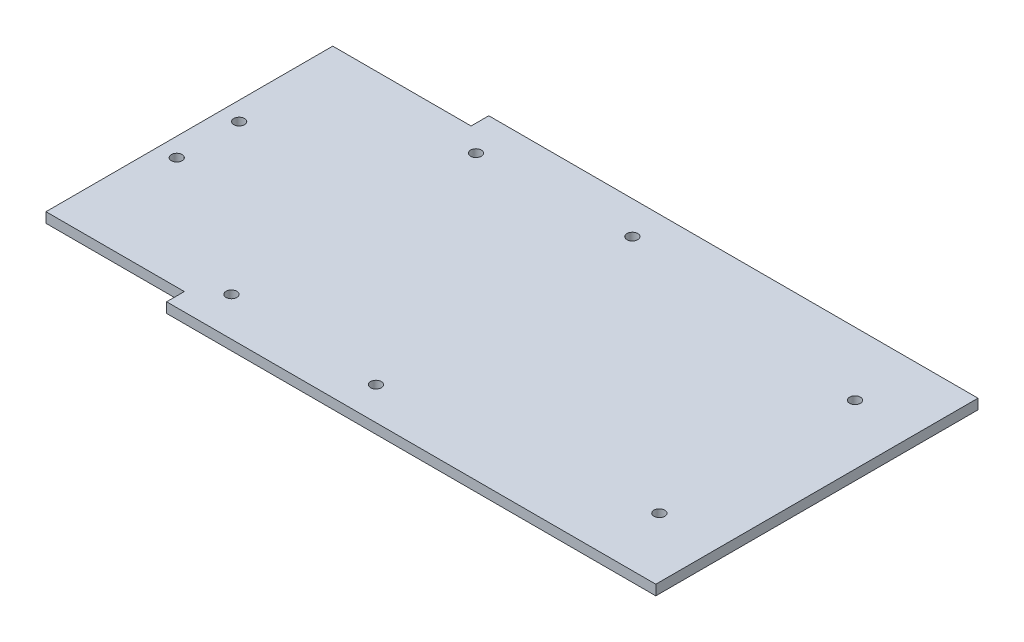
ISO-10303-21;
HEADER;
FILE_DESCRIPTION(('STEP AP214'),'2;1');
FILE_NAME('part.step','',(''),(''),'','','');
FILE_SCHEMA(('AUTOMOTIVE_DESIGN { 1 0 10303 214 1 1 1 1 }'));
ENDSEC;
DATA;
#1=APPLICATION_CONTEXT('core data for automotive mechanical design processes');
#2=APPLICATION_PROTOCOL_DEFINITION('international standard','automotive_design',2000,#1);
#3=PRODUCT_CONTEXT('',#1,'mechanical');
#4=PRODUCT('Part','Part','',(#3));
#5=PRODUCT_RELATED_PRODUCT_CATEGORY('part','',(#4));
#6=PRODUCT_DEFINITION_FORMATION('','',#4);
#7=PRODUCT_DEFINITION_CONTEXT('part definition',#1,'design');
#8=PRODUCT_DEFINITION('design','',#6,#7);
#9=PRODUCT_DEFINITION_SHAPE('','',#8);
#10=(LENGTH_UNIT() NAMED_UNIT(*) SI_UNIT(.MILLI.,.METRE.));
#11=(NAMED_UNIT(*) PLANE_ANGLE_UNIT() SI_UNIT($,.RADIAN.));
#12=(NAMED_UNIT(*) SI_UNIT($,.STERADIAN.) SOLID_ANGLE_UNIT());
#13=UNCERTAINTY_MEASURE_WITH_UNIT(LENGTH_MEASURE(1.E-05),#10,'distance_accuracy_value','');
#14=(GEOMETRIC_REPRESENTATION_CONTEXT(3) GLOBAL_UNCERTAINTY_ASSIGNED_CONTEXT((#13)) GLOBAL_UNIT_ASSIGNED_CONTEXT((#10,
#11,#12)) REPRESENTATION_CONTEXT('',''));
#15=CARTESIAN_POINT('',(0.,0.,0.));
#16=DIRECTION('',(0.,0.,1.));
#17=DIRECTION('',(1.,0.,0.));
#18=AXIS2_PLACEMENT_3D('',#15,#16,#17);
#19=CARTESIAN_POINT('',(186.,3.,-95.5));
#20=DIRECTION('',(-1.,0.,0.));
#21=DIRECTION('',(0.,0.,1.));
#22=AXIS2_PLACEMENT_3D('',#19,#20,#21);
#23=PLANE('',#22);
#24=DIRECTION('',(0.,0.,-1.));
#25=VECTOR('',#24,1.);
#26=CARTESIAN_POINT('',(186.,0.,-95.5));
#27=LINE('',#26,#25);
#28=CARTESIAN_POINT('',(186.,0.,0.));
#29=VERTEX_POINT('',#28);
#30=CARTESIAN_POINT('',(186.,0.,-95.5));
#31=VERTEX_POINT('',#30);
#32=EDGE_CURVE('E132',#29,#31,#27,.T.);
#33=ORIENTED_EDGE('',*,*,#32,.T.);
#34=DIRECTION('',(0.,-1.,0.));
#35=VECTOR('',#34,1.);
#36=CARTESIAN_POINT('',(186.,3.,-95.5));
#37=LINE('',#36,#35);
#38=CARTESIAN_POINT('',(186.,3.,-95.5));
#39=VERTEX_POINT('',#38);
#40=EDGE_CURVE('E11',#39,#31,#37,.T.);
#41=ORIENTED_EDGE('',*,*,#40,.F.);
#42=DIRECTION('',(0.,0.,-1.));
#43=VECTOR('',#42,1.);
#44=CARTESIAN_POINT('',(186.,3.,-95.5));
#45=LINE('',#44,#43);
#46=CARTESIAN_POINT('',(186.,3.,0.));
#47=VERTEX_POINT('',#46);
#48=EDGE_CURVE('E147',#47,#39,#45,.T.);
#49=ORIENTED_EDGE('',*,*,#48,.F.);
#50=DIRECTION('',(0.,-1.,0.));
#51=VECTOR('',#50,1.);
#52=CARTESIAN_POINT('',(186.,3.,0.));
#53=LINE('',#52,#51);
#54=EDGE_CURVE('E128',#47,#29,#53,.T.);
#55=ORIENTED_EDGE('',*,*,#54,.T.);
#56=EDGE_LOOP('',(#33,#41,#49,#55));
#57=FACE_BOUND('',#56,.T.);
#58=ADVANCED_FACE('F36',(#57),#23,.F.);
#59=CARTESIAN_POINT('',(41.,3.,-95.5));
#60=DIRECTION('',(0.,0.,1.));
#61=DIRECTION('',(1.,0.,0.));
#62=AXIS2_PLACEMENT_3D('',#59,#60,#61);
#63=PLANE('',#62);
#64=DIRECTION('',(-1.,0.,0.));
#65=VECTOR('',#64,1.);
#66=CARTESIAN_POINT('',(41.,0.,-95.5));
#67=LINE('',#66,#65);
#68=CARTESIAN_POINT('',(41.,0.,-95.5));
#69=VERTEX_POINT('',#68);
#70=EDGE_CURVE('E135',#31,#69,#67,.T.);
#71=ORIENTED_EDGE('',*,*,#70,.T.);
#72=DIRECTION('',(0.,-1.,0.));
#73=VECTOR('',#72,1.);
#74=CARTESIAN_POINT('',(41.,3.,-95.5));
#75=LINE('',#74,#73);
#76=CARTESIAN_POINT('',(41.,3.,-95.5));
#77=VERTEX_POINT('',#76);
#78=EDGE_CURVE('E44',#77,#69,#75,.T.);
#79=ORIENTED_EDGE('',*,*,#78,.F.);
#80=DIRECTION('',(-1.,0.,0.));
#81=VECTOR('',#80,1.);
#82=CARTESIAN_POINT('',(41.,3.,-95.5));
#83=LINE('',#82,#81);
#84=EDGE_CURVE('E95',#39,#77,#83,.T.);
#85=ORIENTED_EDGE('',*,*,#84,.F.);
#86=ORIENTED_EDGE('',*,*,#40,.T.);
#87=EDGE_LOOP('',(#71,#79,#85,#86));
#88=FACE_BOUND('',#87,.T.);
#89=ADVANCED_FACE('F265',(#88),#63,.F.);
#90=CARTESIAN_POINT('',(41.,3.,-95.5));
#91=DIRECTION('',(1.,0.,0.));
#92=DIRECTION('',(0.,0.,-1.));
#93=AXIS2_PLACEMENT_3D('',#90,#91,#92);
#94=PLANE('',#93);
#95=DIRECTION('',(0.,0.,1.));
#96=VECTOR('',#95,1.);
#97=CARTESIAN_POINT('',(41.,0.,-95.5));
#98=LINE('',#97,#96);
#99=CARTESIAN_POINT('',(41.,0.,-90.25));
#100=VERTEX_POINT('',#99);
#101=EDGE_CURVE('E138',#69,#100,#98,.T.);
#102=ORIENTED_EDGE('',*,*,#101,.T.);
#103=DIRECTION('',(0.,-1.,0.));
#104=VECTOR('',#103,1.);
#105=CARTESIAN_POINT('',(41.,3.,-90.25));
#106=LINE('',#105,#104);
#107=CARTESIAN_POINT('',(41.,3.,-90.25));
#108=VERTEX_POINT('',#107);
#109=EDGE_CURVE('E154',#108,#100,#106,.T.);
#110=ORIENTED_EDGE('',*,*,#109,.F.);
#111=DIRECTION('',(0.,0.,1.));
#112=VECTOR('',#111,1.);
#113=CARTESIAN_POINT('',(41.,3.,-95.5));
#114=LINE('',#113,#112);
#115=EDGE_CURVE('E162',#77,#108,#114,.T.);
#116=ORIENTED_EDGE('',*,*,#115,.F.);
#117=ORIENTED_EDGE('',*,*,#78,.T.);
#118=EDGE_LOOP('',(#102,#110,#116,#117));
#119=FACE_BOUND('',#118,.T.);
#120=ADVANCED_FACE('F160',(#119),#94,.F.);
#121=CARTESIAN_POINT('',(0.,3.,-90.25));
#122=DIRECTION('',(0.,0.,1.));
#123=DIRECTION('',(1.,0.,0.));
#124=AXIS2_PLACEMENT_3D('',#121,#122,#123);
#125=PLANE('',#124);
#126=DIRECTION('',(-1.,0.,0.));
#127=VECTOR('',#126,1.);
#128=CARTESIAN_POINT('',(0.,0.,-90.25));
#129=LINE('',#128,#127);
#130=CARTESIAN_POINT('',(0.,0.,-90.25));
#131=VERTEX_POINT('',#130);
#132=EDGE_CURVE('E140',#100,#131,#129,.T.);
#133=ORIENTED_EDGE('',*,*,#132,.T.);
#134=DIRECTION('',(0.,-1.,0.));
#135=VECTOR('',#134,1.);
#136=CARTESIAN_POINT('',(0.,3.,-90.25));
#137=LINE('',#136,#135);
#138=CARTESIAN_POINT('',(0.,3.,-90.25));
#139=VERTEX_POINT('',#138);
#140=EDGE_CURVE('E151',#139,#131,#137,.T.);
#141=ORIENTED_EDGE('',*,*,#140,.F.);
#142=DIRECTION('',(-1.,0.,0.));
#143=VECTOR('',#142,1.);
#144=CARTESIAN_POINT('',(0.,3.,-90.25));
#145=LINE('',#144,#143);
#146=EDGE_CURVE('E174',#108,#139,#145,.T.);
#147=ORIENTED_EDGE('',*,*,#146,.F.);
#148=ORIENTED_EDGE('',*,*,#109,.T.);
#149=EDGE_LOOP('',(#133,#141,#147,#148));
#150=FACE_BOUND('',#149,.T.);
#151=ADVANCED_FACE('F170',(#150),#125,.F.);
#152=CARTESIAN_POINT('',(0.,3.,-90.25));
#153=DIRECTION('',(1.,0.,0.));
#154=DIRECTION('',(0.,0.,-1.));
#155=AXIS2_PLACEMENT_3D('',#152,#153,#154);
#156=PLANE('',#155);
#157=DIRECTION('',(0.,0.,1.));
#158=VECTOR('',#157,1.);
#159=CARTESIAN_POINT('',(0.,0.,-90.25));
#160=LINE('',#159,#158);
#161=CARTESIAN_POINT('',(0.,0.,-5.25));
#162=VERTEX_POINT('',#161);
#163=EDGE_CURVE('E142',#131,#162,#160,.T.);
#164=ORIENTED_EDGE('',*,*,#163,.T.);
#165=DIRECTION('',(0.,-1.,0.));
#166=VECTOR('',#165,1.);
#167=CARTESIAN_POINT('',(0.,3.,-5.25));
#168=LINE('',#167,#166);
#169=CARTESIAN_POINT('',(0.,3.,-5.25));
#170=VERTEX_POINT('',#169);
#171=EDGE_CURVE('E123',#170,#162,#168,.T.);
#172=ORIENTED_EDGE('',*,*,#171,.F.);
#173=DIRECTION('',(0.,0.,1.));
#174=VECTOR('',#173,1.);
#175=CARTESIAN_POINT('',(0.,3.,-90.25));
#176=LINE('',#175,#174);
#177=EDGE_CURVE('E114',#139,#170,#176,.T.);
#178=ORIENTED_EDGE('',*,*,#177,.F.);
#179=ORIENTED_EDGE('',*,*,#140,.T.);
#180=EDGE_LOOP('',(#164,#172,#178,#179));
#181=FACE_BOUND('',#180,.T.);
#182=ADVANCED_FACE('F173',(#181),#156,.F.);
#183=CARTESIAN_POINT('',(0.,3.,-5.25));
#184=DIRECTION('',(0.,0.,-1.));
#185=DIRECTION('',(-1.,0.,0.));
#186=AXIS2_PLACEMENT_3D('',#183,#184,#185);
#187=PLANE('',#186);
#188=DIRECTION('',(1.,0.,0.));
#189=VECTOR('',#188,1.);
#190=CARTESIAN_POINT('',(0.,0.,-5.25));
#191=LINE('',#190,#189);
#192=CARTESIAN_POINT('',(41.,0.,-5.25));
#193=VERTEX_POINT('',#192);
#194=EDGE_CURVE('E122',#162,#193,#191,.T.);
#195=ORIENTED_EDGE('',*,*,#194,.T.);
#196=DIRECTION('',(0.,-1.,0.));
#197=VECTOR('',#196,1.);
#198=CARTESIAN_POINT('',(41.,3.,-5.25));
#199=LINE('',#198,#197);
#200=CARTESIAN_POINT('',(41.,3.,-5.25));
#201=VERTEX_POINT('',#200);
#202=EDGE_CURVE('E119',#201,#193,#199,.T.);
#203=ORIENTED_EDGE('',*,*,#202,.F.);
#204=DIRECTION('',(1.,0.,0.));
#205=VECTOR('',#204,1.);
#206=CARTESIAN_POINT('',(0.,3.,-5.25));
#207=LINE('',#206,#205);
#208=EDGE_CURVE('E108',#170,#201,#207,.T.);
#209=ORIENTED_EDGE('',*,*,#208,.F.);
#210=ORIENTED_EDGE('',*,*,#171,.T.);
#211=EDGE_LOOP('',(#195,#203,#209,#210));
#212=FACE_BOUND('',#211,.T.);
#213=ADVANCED_FACE('F120',(#212),#187,.F.);
#214=CARTESIAN_POINT('',(41.,3.,-5.25));
#215=DIRECTION('',(1.,0.,0.));
#216=DIRECTION('',(0.,0.,-1.));
#217=AXIS2_PLACEMENT_3D('',#214,#215,#216);
#218=PLANE('',#217);
#219=DIRECTION('',(0.,0.,1.));
#220=VECTOR('',#219,1.);
#221=CARTESIAN_POINT('',(41.,0.,-5.25));
#222=LINE('',#221,#220);
#223=CARTESIAN_POINT('',(41.,0.,0.));
#224=VERTEX_POINT('',#223);
#225=EDGE_CURVE('E81',#193,#224,#222,.T.);
#226=ORIENTED_EDGE('',*,*,#225,.T.);
#227=DIRECTION('',(0.,-1.,0.));
#228=VECTOR('',#227,1.);
#229=CARTESIAN_POINT('',(41.,3.,0.));
#230=LINE('',#229,#228);
#231=CARTESIAN_POINT('',(41.,3.,0.));
#232=VERTEX_POINT('',#231);
#233=EDGE_CURVE('E124',#232,#224,#230,.T.);
#234=ORIENTED_EDGE('',*,*,#233,.F.);
#235=DIRECTION('',(0.,0.,1.));
#236=VECTOR('',#235,1.);
#237=CARTESIAN_POINT('',(41.,3.,-5.25));
#238=LINE('',#237,#236);
#239=EDGE_CURVE('E112',#201,#232,#238,.T.);
#240=ORIENTED_EDGE('',*,*,#239,.F.);
#241=ORIENTED_EDGE('',*,*,#202,.T.);
#242=EDGE_LOOP('',(#226,#234,#240,#241));
#243=FACE_BOUND('',#242,.T.);
#244=ADVANCED_FACE('F126',(#243),#218,.F.);
#245=CARTESIAN_POINT('',(41.,3.,0.));
#246=DIRECTION('',(0.,0.,-1.));
#247=DIRECTION('',(-1.,0.,0.));
#248=AXIS2_PLACEMENT_3D('',#245,#246,#247);
#249=PLANE('',#248);
#250=DIRECTION('',(1.,0.,0.));
#251=VECTOR('',#250,1.);
#252=CARTESIAN_POINT('',(41.,0.,0.));
#253=LINE('',#252,#251);
#254=EDGE_CURVE('E87',#224,#29,#253,.T.);
#255=ORIENTED_EDGE('',*,*,#254,.T.);
#256=ORIENTED_EDGE('',*,*,#54,.F.);
#257=DIRECTION('',(1.,0.,0.));
#258=VECTOR('',#257,1.);
#259=CARTESIAN_POINT('',(41.,3.,0.));
#260=LINE('',#259,#258);
#261=EDGE_CURVE('E52',#232,#47,#260,.T.);
#262=ORIENTED_EDGE('',*,*,#261,.F.);
#263=ORIENTED_EDGE('',*,*,#233,.T.);
#264=EDGE_LOOP('',(#255,#256,#262,#263));
#265=FACE_BOUND('',#264,.T.);
#266=ADVANCED_FACE('F240',(#265),#249,.F.);
#267=CARTESIAN_POINT('',(0.,3.,0.));
#268=DIRECTION('',(0.,1.,0.));
#269=DIRECTION('',(0.,0.,1.));
#270=AXIS2_PLACEMENT_3D('',#267,#268,#269);
#271=PLANE('',#270);
#272=CARTESIAN_POINT('',(93.3,3.,-9.75));
#273=DIRECTION('',(0.,1.,0.));
#274=DIRECTION('',(0.,0.,1.));
#275=AXIS2_PLACEMENT_3D('',#272,#273,#274);
#276=CIRCLE('',#275,1.6);
#277=CARTESIAN_POINT('',(93.3,3.,-8.15));
#278=VERTEX_POINT('',#277);
#279=EDGE_CURVE('E198',#278,#278,#276,.T.);
#280=ORIENTED_EDGE('',*,*,#279,.F.);
#281=EDGE_LOOP('',(#280));
#282=FACE_BOUND('',#281,.T.);
#283=CARTESIAN_POINT('',(48.7,3.,-84.));
#284=DIRECTION('',(0.,1.,0.));
#285=DIRECTION('',(0.,0.,-1.));
#286=AXIS2_PLACEMENT_3D('',#283,#284,#285);
#287=CIRCLE('',#286,1.6);
#288=CARTESIAN_POINT('',(48.7,3.,-85.6));
#289=VERTEX_POINT('',#288);
#290=EDGE_CURVE('E205',#289,#289,#287,.T.);
#291=ORIENTED_EDGE('',*,*,#290,.F.);
#292=EDGE_LOOP('',(#291));
#293=FACE_BOUND('',#292,.T.);
#294=CARTESIAN_POINT('',(93.3,3.,-85.75));
#295=DIRECTION('',(0.,1.,0.));
#296=DIRECTION('',(0.,0.,-1.));
#297=AXIS2_PLACEMENT_3D('',#294,#295,#296);
#298=CIRCLE('',#297,1.60000000000001);
#299=CARTESIAN_POINT('',(93.3,3.,-87.35));
#300=VERTEX_POINT('',#299);
#301=EDGE_CURVE('E186',#300,#300,#298,.T.);
#302=ORIENTED_EDGE('',*,*,#301,.F.);
#303=EDGE_LOOP('',(#302));
#304=FACE_BOUND('',#303,.T.);
#305=CARTESIAN_POINT('',(168.3,3.,-76.75));
#306=DIRECTION('',(0.,1.,0.));
#307=DIRECTION('',(0.,0.,-1.));
#308=AXIS2_PLACEMENT_3D('',#305,#306,#307);
#309=CIRCLE('',#308,1.59999999999999);
#310=CARTESIAN_POINT('',(168.3,3.,-78.35));
#311=VERTEX_POINT('',#310);
#312=EDGE_CURVE('E193',#311,#311,#309,.T.);
#313=ORIENTED_EDGE('',*,*,#312,.F.);
#314=EDGE_LOOP('',(#313));
#315=FACE_BOUND('',#314,.T.);
#316=CARTESIAN_POINT('',(5.50000000000001,3.,-57.));
#317=DIRECTION('',(0.,1.,0.));
#318=DIRECTION('',(0.,0.,1.));
#319=AXIS2_PLACEMENT_3D('',#316,#317,#318);
#320=CIRCLE('',#319,1.60000000000001);
#321=CARTESIAN_POINT('',(5.50000000000001,3.,-55.4));
#322=VERTEX_POINT('',#321);
#323=EDGE_CURVE('E222',#322,#322,#320,.T.);
#324=ORIENTED_EDGE('',*,*,#323,.F.);
#325=EDGE_LOOP('',(#324));
#326=FACE_BOUND('',#325,.T.);
#327=CARTESIAN_POINT('',(168.3,3.,-18.75));
#328=DIRECTION('',(0.,1.,0.));
#329=DIRECTION('',(0.,0.,1.));
#330=AXIS2_PLACEMENT_3D('',#327,#328,#329);
#331=CIRCLE('',#330,1.59999999999999);
#332=CARTESIAN_POINT('',(168.3,3.,-17.15));
#333=VERTEX_POINT('',#332);
#334=EDGE_CURVE('E216',#333,#333,#331,.T.);
#335=ORIENTED_EDGE('',*,*,#334,.F.);
#336=EDGE_LOOP('',(#335));
#337=FACE_BOUND('',#336,.T.);
#338=CARTESIAN_POINT('',(48.7,3.,-11.5));
#339=DIRECTION('',(0.,1.,0.));
#340=DIRECTION('',(0.,0.,1.));
#341=AXIS2_PLACEMENT_3D('',#338,#339,#340);
#342=CIRCLE('',#341,1.6);
#343=CARTESIAN_POINT('',(48.7,3.,-9.9));
#344=VERTEX_POINT('',#343);
#345=EDGE_CURVE('E210',#344,#344,#342,.T.);
#346=ORIENTED_EDGE('',*,*,#345,.F.);
#347=EDGE_LOOP('',(#346));
#348=FACE_BOUND('',#347,.T.);
#349=CARTESIAN_POINT('',(5.50000000000001,3.,-38.5));
#350=DIRECTION('',(0.,1.,0.));
#351=DIRECTION('',(0.,0.,1.));
#352=AXIS2_PLACEMENT_3D('',#349,#350,#351);
#353=CIRCLE('',#352,1.6);
#354=CARTESIAN_POINT('',(5.50000000000001,3.,-36.9));
#355=VERTEX_POINT('',#354);
#356=EDGE_CURVE('E180',#355,#355,#353,.T.);
#357=ORIENTED_EDGE('',*,*,#356,.F.);
#358=EDGE_LOOP('',(#357));
#359=FACE_BOUND('',#358,.T.);
#360=ORIENTED_EDGE('',*,*,#48,.T.);
#361=ORIENTED_EDGE('',*,*,#84,.T.);
#362=ORIENTED_EDGE('',*,*,#115,.T.);
#363=ORIENTED_EDGE('',*,*,#146,.T.);
#364=ORIENTED_EDGE('',*,*,#177,.T.);
#365=ORIENTED_EDGE('',*,*,#208,.T.);
#366=ORIENTED_EDGE('',*,*,#239,.T.);
#367=ORIENTED_EDGE('',*,*,#261,.T.);
#368=EDGE_LOOP('',(#360,#361,#362,#363,#364,#365,#366,#367));
#369=FACE_BOUND('',#368,.T.);
#370=ADVANCED_FACE('F110',(#282,#293,#304,#315,#326,#337,#348,#359,#369),#271,.T.);
#371=CARTESIAN_POINT('',(0.,0.,0.));
#372=DIRECTION('',(0.,1.,0.));
#373=DIRECTION('',(0.,0.,1.));
#374=AXIS2_PLACEMENT_3D('',#371,#372,#373);
#375=PLANE('',#374);
#376=CARTESIAN_POINT('',(93.3,0.,-9.75));
#377=DIRECTION('',(0.,1.,0.));
#378=DIRECTION('',(0.,0.,1.));
#379=AXIS2_PLACEMENT_3D('',#376,#377,#378);
#380=CIRCLE('',#379,1.6);
#381=CARTESIAN_POINT('',(93.3,0.,-8.15));
#382=VERTEX_POINT('',#381);
#383=EDGE_CURVE('E201',#382,#382,#380,.T.);
#384=ORIENTED_EDGE('',*,*,#383,.T.);
#385=EDGE_LOOP('',(#384));
#386=FACE_BOUND('',#385,.T.);
#387=CARTESIAN_POINT('',(48.7,0.,-84.));
#388=DIRECTION('',(0.,1.,0.));
#389=DIRECTION('',(0.,0.,-1.));
#390=AXIS2_PLACEMENT_3D('',#387,#388,#389);
#391=CIRCLE('',#390,1.6);
#392=CARTESIAN_POINT('',(48.7,0.,-85.6));
#393=VERTEX_POINT('',#392);
#394=EDGE_CURVE('E190',#393,#393,#391,.T.);
#395=ORIENTED_EDGE('',*,*,#394,.T.);
#396=EDGE_LOOP('',(#395));
#397=FACE_BOUND('',#396,.T.);
#398=CARTESIAN_POINT('',(93.3,0.,-85.75));
#399=DIRECTION('',(0.,1.,0.));
#400=DIRECTION('',(0.,0.,-1.));
#401=AXIS2_PLACEMENT_3D('',#398,#399,#400);
#402=CIRCLE('',#401,1.60000000000001);
#403=CARTESIAN_POINT('',(93.3,0.,-87.35));
#404=VERTEX_POINT('',#403);
#405=EDGE_CURVE('E189',#404,#404,#402,.T.);
#406=ORIENTED_EDGE('',*,*,#405,.T.);
#407=EDGE_LOOP('',(#406));
#408=FACE_BOUND('',#407,.T.);
#409=CARTESIAN_POINT('',(168.3,0.,-76.75));
#410=DIRECTION('',(0.,1.,0.));
#411=DIRECTION('',(0.,0.,-1.));
#412=AXIS2_PLACEMENT_3D('',#409,#410,#411);
#413=CIRCLE('',#412,1.59999999999999);
#414=CARTESIAN_POINT('',(168.3,0.,-78.35));
#415=VERTEX_POINT('',#414);
#416=EDGE_CURVE('E183',#415,#415,#413,.T.);
#417=ORIENTED_EDGE('',*,*,#416,.T.);
#418=EDGE_LOOP('',(#417));
#419=FACE_BOUND('',#418,.T.);
#420=CARTESIAN_POINT('',(5.50000000000001,0.,-57.));
#421=DIRECTION('',(0.,1.,0.));
#422=DIRECTION('',(0.,0.,1.));
#423=AXIS2_PLACEMENT_3D('',#420,#421,#422);
#424=CIRCLE('',#423,1.60000000000001);
#425=CARTESIAN_POINT('',(5.50000000000001,0.,-55.4));
#426=VERTEX_POINT('',#425);
#427=EDGE_CURVE('E202',#426,#426,#424,.T.);
#428=ORIENTED_EDGE('',*,*,#427,.T.);
#429=EDGE_LOOP('',(#428));
#430=FACE_BOUND('',#429,.T.);
#431=CARTESIAN_POINT('',(168.3,0.,-18.75));
#432=DIRECTION('',(0.,1.,0.));
#433=DIRECTION('',(0.,0.,1.));
#434=AXIS2_PLACEMENT_3D('',#431,#432,#433);
#435=CIRCLE('',#434,1.59999999999999);
#436=CARTESIAN_POINT('',(168.3,0.,-17.15));
#437=VERTEX_POINT('',#436);
#438=EDGE_CURVE('E219',#437,#437,#435,.T.);
#439=ORIENTED_EDGE('',*,*,#438,.T.);
#440=EDGE_LOOP('',(#439));
#441=FACE_BOUND('',#440,.T.);
#442=CARTESIAN_POINT('',(48.7,0.,-11.5));
#443=DIRECTION('',(0.,1.,0.));
#444=DIRECTION('',(0.,0.,1.));
#445=AXIS2_PLACEMENT_3D('',#442,#443,#444);
#446=CIRCLE('',#445,1.6);
#447=CARTESIAN_POINT('',(48.7,0.,-9.9));
#448=VERTEX_POINT('',#447);
#449=EDGE_CURVE('E213',#448,#448,#446,.T.);
#450=ORIENTED_EDGE('',*,*,#449,.T.);
#451=EDGE_LOOP('',(#450));
#452=FACE_BOUND('',#451,.T.);
#453=CARTESIAN_POINT('',(5.50000000000001,0.,-38.5));
#454=DIRECTION('',(0.,1.,0.));
#455=DIRECTION('',(0.,0.,1.));
#456=AXIS2_PLACEMENT_3D('',#453,#454,#455);
#457=CIRCLE('',#456,1.6);
#458=CARTESIAN_POINT('',(5.50000000000001,0.,-36.9));
#459=VERTEX_POINT('',#458);
#460=EDGE_CURVE('E136',#459,#459,#457,.T.);
#461=ORIENTED_EDGE('',*,*,#460,.T.);
#462=EDGE_LOOP('',(#461));
#463=FACE_BOUND('',#462,.T.);
#464=ORIENTED_EDGE('',*,*,#32,.F.);
#465=ORIENTED_EDGE('',*,*,#254,.F.);
#466=ORIENTED_EDGE('',*,*,#225,.F.);
#467=ORIENTED_EDGE('',*,*,#194,.F.);
#468=ORIENTED_EDGE('',*,*,#163,.F.);
#469=ORIENTED_EDGE('',*,*,#132,.F.);
#470=ORIENTED_EDGE('',*,*,#101,.F.);
#471=ORIENTED_EDGE('',*,*,#70,.F.);
#472=EDGE_LOOP('',(#464,#465,#466,#467,#468,#469,#470,#471));
#473=FACE_BOUND('',#472,.T.);
#474=ADVANCED_FACE('F166',(#386,#397,#408,#419,#430,#441,#452,#463,#473),#375,.F.);
#475=CARTESIAN_POINT('',(5.50000000000001,0.,-38.5));
#476=DIRECTION('',(0.,1.,0.));
#477=DIRECTION('',(0.,0.,1.));
#478=AXIS2_PLACEMENT_3D('',#475,#476,#477);
#479=CYLINDRICAL_SURFACE('',#478,1.6);
#480=ORIENTED_EDGE('',*,*,#460,.F.);
#481=EDGE_LOOP('',(#480));
#482=FACE_BOUND('',#481,.T.);
#483=ORIENTED_EDGE('',*,*,#356,.T.);
#484=EDGE_LOOP('',(#483));
#485=FACE_BOUND('',#484,.T.);
#486=ADVANCED_FACE('F249',(#482,#485),#479,.F.);
#487=CARTESIAN_POINT('',(48.7,0.,-11.5));
#488=DIRECTION('',(0.,1.,0.));
#489=DIRECTION('',(0.,0.,1.));
#490=AXIS2_PLACEMENT_3D('',#487,#488,#489);
#491=CYLINDRICAL_SURFACE('',#490,1.6);
#492=ORIENTED_EDGE('',*,*,#449,.F.);
#493=EDGE_LOOP('',(#492));
#494=FACE_BOUND('',#493,.T.);
#495=ORIENTED_EDGE('',*,*,#345,.T.);
#496=EDGE_LOOP('',(#495));
#497=FACE_BOUND('',#496,.T.);
#498=ADVANCED_FACE('F251',(#494,#497),#491,.F.);
#499=CARTESIAN_POINT('',(168.3,0.,-18.75));
#500=DIRECTION('',(0.,1.,0.));
#501=DIRECTION('',(0.,0.,1.));
#502=AXIS2_PLACEMENT_3D('',#499,#500,#501);
#503=CYLINDRICAL_SURFACE('',#502,1.59999999999999);
#504=ORIENTED_EDGE('',*,*,#438,.F.);
#505=EDGE_LOOP('',(#504));
#506=FACE_BOUND('',#505,.T.);
#507=ORIENTED_EDGE('',*,*,#334,.T.);
#508=EDGE_LOOP('',(#507));
#509=FACE_BOUND('',#508,.T.);
#510=ADVANCED_FACE('F234',(#506,#509),#503,.F.);
#511=CARTESIAN_POINT('',(5.50000000000001,0.,-57.));
#512=DIRECTION('',(0.,1.,0.));
#513=DIRECTION('',(0.,0.,1.));
#514=AXIS2_PLACEMENT_3D('',#511,#512,#513);
#515=CYLINDRICAL_SURFACE('',#514,1.60000000000001);
#516=ORIENTED_EDGE('',*,*,#427,.F.);
#517=EDGE_LOOP('',(#516));
#518=FACE_BOUND('',#517,.T.);
#519=ORIENTED_EDGE('',*,*,#323,.T.);
#520=EDGE_LOOP('',(#519));
#521=FACE_BOUND('',#520,.T.);
#522=ADVANCED_FACE('F230',(#518,#521),#515,.F.);
#523=CARTESIAN_POINT('',(168.3,0.,-76.75));
#524=DIRECTION('',(0.,1.,0.));
#525=DIRECTION('',(0.,0.,1.));
#526=AXIS2_PLACEMENT_3D('',#523,#524,#525);
#527=CYLINDRICAL_SURFACE('',#526,1.59999999999999);
#528=ORIENTED_EDGE('',*,*,#416,.F.);
#529=EDGE_LOOP('',(#528));
#530=FACE_BOUND('',#529,.T.);
#531=ORIENTED_EDGE('',*,*,#312,.T.);
#532=EDGE_LOOP('',(#531));
#533=FACE_BOUND('',#532,.T.);
#534=ADVANCED_FACE('F233',(#530,#533),#527,.F.);
#535=CARTESIAN_POINT('',(93.3,0.,-85.75));
#536=DIRECTION('',(0.,1.,0.));
#537=DIRECTION('',(0.,0.,1.));
#538=AXIS2_PLACEMENT_3D('',#535,#536,#537);
#539=CYLINDRICAL_SURFACE('',#538,1.60000000000001);
#540=ORIENTED_EDGE('',*,*,#405,.F.);
#541=EDGE_LOOP('',(#540));
#542=FACE_BOUND('',#541,.T.);
#543=ORIENTED_EDGE('',*,*,#301,.T.);
#544=EDGE_LOOP('',(#543));
#545=FACE_BOUND('',#544,.T.);
#546=ADVANCED_FACE('F356',(#542,#545),#539,.F.);
#547=CARTESIAN_POINT('',(48.7,0.,-84.));
#548=DIRECTION('',(0.,1.,0.));
#549=DIRECTION('',(0.,0.,1.));
#550=AXIS2_PLACEMENT_3D('',#547,#548,#549);
#551=CYLINDRICAL_SURFACE('',#550,1.6);
#552=ORIENTED_EDGE('',*,*,#394,.F.);
#553=EDGE_LOOP('',(#552));
#554=FACE_BOUND('',#553,.T.);
#555=ORIENTED_EDGE('',*,*,#290,.T.);
#556=EDGE_LOOP('',(#555));
#557=FACE_BOUND('',#556,.T.);
#558=ADVANCED_FACE('F366',(#554,#557),#551,.F.);
#559=CARTESIAN_POINT('',(93.3,0.,-9.75));
#560=DIRECTION('',(0.,1.,0.));
#561=DIRECTION('',(0.,0.,1.));
#562=AXIS2_PLACEMENT_3D('',#559,#560,#561);
#563=CYLINDRICAL_SURFACE('',#562,1.6);
#564=ORIENTED_EDGE('',*,*,#383,.F.);
#565=EDGE_LOOP('',(#564));
#566=FACE_BOUND('',#565,.T.);
#567=ORIENTED_EDGE('',*,*,#279,.T.);
#568=EDGE_LOOP('',(#567));
#569=FACE_BOUND('',#568,.T.);
#570=ADVANCED_FACE('F375',(#566,#569),#563,.F.);
#571=CLOSED_SHELL('',(#58,#89,#120,#151,#182,#213,#244,#266,#370,#474,#486,#498,#510,#522,#534,
#546,#558,#570));
#572=MANIFOLD_SOLID_BREP('B2',#571);
#573=ADVANCED_BREP_SHAPE_REPRESENTATION('',(#18,#572),#14);
#574=SHAPE_DEFINITION_REPRESENTATION(#9,#573);
ENDSEC;
END-ISO-10303-21;
